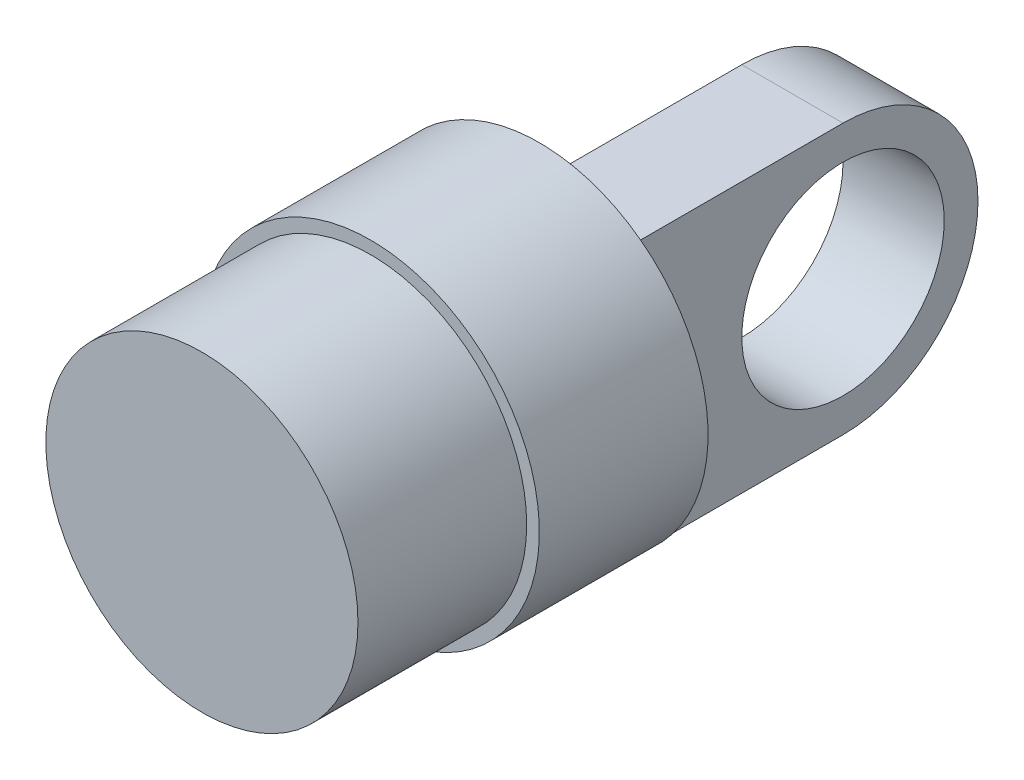
ISO-10303-21;
HEADER;
FILE_DESCRIPTION(('STEP AP214'),'2;1');
FILE_NAME('part.step','',(''),(''),'','','');
FILE_SCHEMA(('AUTOMOTIVE_DESIGN { 1 0 10303 214 1 1 1 1 }'));
ENDSEC;
DATA;
#1=APPLICATION_CONTEXT('core data for automotive mechanical design processes');
#2=APPLICATION_PROTOCOL_DEFINITION('international standard','automotive_design',2000,#1);
#3=PRODUCT_CONTEXT('',#1,'mechanical');
#4=PRODUCT('Part','Part','',(#3));
#5=PRODUCT_RELATED_PRODUCT_CATEGORY('part','',(#4));
#6=PRODUCT_DEFINITION_FORMATION('','',#4);
#7=PRODUCT_DEFINITION_CONTEXT('part definition',#1,'design');
#8=PRODUCT_DEFINITION('design','',#6,#7);
#9=PRODUCT_DEFINITION_SHAPE('','',#8);
#10=(LENGTH_UNIT() NAMED_UNIT(*) SI_UNIT(.MILLI.,.METRE.));
#11=(NAMED_UNIT(*) PLANE_ANGLE_UNIT() SI_UNIT($,.RADIAN.));
#12=(NAMED_UNIT(*) SI_UNIT($,.STERADIAN.) SOLID_ANGLE_UNIT());
#13=UNCERTAINTY_MEASURE_WITH_UNIT(LENGTH_MEASURE(1.E-05),#10,'distance_accuracy_value','');
#14=(GEOMETRIC_REPRESENTATION_CONTEXT(3) GLOBAL_UNCERTAINTY_ASSIGNED_CONTEXT((#13)) GLOBAL_UNIT_ASSIGNED_CONTEXT((#10,
#11,#12)) REPRESENTATION_CONTEXT('',''));
#15=CARTESIAN_POINT('',(0.,0.,0.));
#16=DIRECTION('',(0.,0.,1.));
#17=DIRECTION('',(1.,0.,0.));
#18=AXIS2_PLACEMENT_3D('',#15,#16,#17);
#19=CARTESIAN_POINT('',(6.,-8.,-30.));
#20=DIRECTION('',(1.,0.,0.));
#21=DIRECTION('',(0.,0.,-1.));
#22=AXIS2_PLACEMENT_3D('',#19,#20,#21);
#23=PLANE('',#22);
#24=CARTESIAN_POINT('',(6.,0.,-22.));
#25=DIRECTION('',(1.,0.,0.));
#26=DIRECTION('',(0.,0.,-1.));
#27=AXIS2_PLACEMENT_3D('',#24,#25,#26);
#28=CIRCLE('',#27,6.);
#29=CARTESIAN_POINT('',(6.,0.,-28.));
#30=VERTEX_POINT('',#29);
#31=EDGE_CURVE('E204',#30,#30,#28,.T.);
#32=ORIENTED_EDGE('',*,*,#31,.F.);
#33=EDGE_LOOP('',(#32));
#34=FACE_BOUND('',#33,.T.);
#35=DIRECTION('',(0.,0.,1.));
#36=VECTOR('',#35,1.);
#37=CARTESIAN_POINT('',(6.,-8.,-30.));
#38=LINE('',#37,#36);
#39=CARTESIAN_POINT('',(6.,-8.,-22.));
#40=VERTEX_POINT('',#39);
#41=CARTESIAN_POINT('',(6.,-8.,-10.));
#42=VERTEX_POINT('',#41);
#43=EDGE_CURVE('E142',#40,#42,#38,.T.);
#44=ORIENTED_EDGE('',*,*,#43,.F.);
#45=CARTESIAN_POINT('',(6.,0.,-22.));
#46=DIRECTION('',(1.,0.,0.));
#47=DIRECTION('',(0.,0.,-1.));
#48=AXIS2_PLACEMENT_3D('',#45,#46,#47);
#49=CIRCLE('',#48,8.);
#50=CARTESIAN_POINT('',(6.,8.,-22.));
#51=VERTEX_POINT('',#50);
#52=EDGE_CURVE('E138',#40,#51,#49,.T.);
#53=ORIENTED_EDGE('',*,*,#52,.T.);
#54=DIRECTION('',(0.,0.,1.));
#55=VECTOR('',#54,1.);
#56=CARTESIAN_POINT('',(6.,8.,-30.));
#57=LINE('',#56,#55);
#58=CARTESIAN_POINT('',(6.,8.,-10.));
#59=VERTEX_POINT('',#58);
#60=EDGE_CURVE('E135',#51,#59,#57,.T.);
#61=ORIENTED_EDGE('',*,*,#60,.T.);
#62=DIRECTION('',(0.,1.,0.));
#63=VECTOR('',#62,1.);
#64=CARTESIAN_POINT('',(6.,-8.,-10.));
#65=LINE('',#64,#63);
#66=EDGE_CURVE('E133',#42,#59,#65,.T.);
#67=ORIENTED_EDGE('',*,*,#66,.F.);
#68=EDGE_LOOP('',(#44,#53,#61,#67));
#69=FACE_BOUND('',#68,.T.);
#70=ADVANCED_FACE('F72',(#34,#69),#23,.T.);
#71=CARTESIAN_POINT('',(6.,-8.,-30.));
#72=DIRECTION('',(0.,1.,0.));
#73=DIRECTION('',(0.,0.,1.));
#74=AXIS2_PLACEMENT_3D('',#71,#72,#73);
#75=PLANE('',#74);
#76=DIRECTION('',(-1.,0.,0.));
#77=VECTOR('',#76,1.);
#78=CARTESIAN_POINT('',(6.,-8.,-10.));
#79=LINE('',#78,#77);
#80=CARTESIAN_POINT('',(0.,-8.,-10.));
#81=VERTEX_POINT('',#80);
#82=EDGE_CURVE('E132',#42,#81,#79,.T.);
#83=ORIENTED_EDGE('',*,*,#82,.T.);
#84=DIRECTION('',(0.,0.,-1.));
#85=VECTOR('',#84,1.);
#86=CARTESIAN_POINT('',(0.,-8.,-30.));
#87=LINE('',#86,#85);
#88=CARTESIAN_POINT('',(0.,-8.,-22.));
#89=VERTEX_POINT('',#88);
#90=EDGE_CURVE('E116',#81,#89,#87,.T.);
#91=ORIENTED_EDGE('',*,*,#90,.T.);
#92=DIRECTION('',(1.,0.,0.));
#93=VECTOR('',#92,1.);
#94=CARTESIAN_POINT('',(-24.,-8.,-22.));
#95=LINE('',#94,#93);
#96=EDGE_CURVE('E12',#40,#89,#95,.F.);
#97=ORIENTED_EDGE('',*,*,#96,.F.);
#98=ORIENTED_EDGE('',*,*,#43,.T.);
#99=EDGE_LOOP('',(#83,#91,#97,#98));
#100=FACE_BOUND('',#99,.T.);
#101=ADVANCED_FACE('F176',(#100),#75,.F.);
#102=CARTESIAN_POINT('',(6.,8.,-30.));
#103=DIRECTION('',(0.,1.,0.));
#104=DIRECTION('',(0.,0.,1.));
#105=AXIS2_PLACEMENT_3D('',#102,#103,#104);
#106=PLANE('',#105);
#107=DIRECTION('',(0.,0.,-1.));
#108=VECTOR('',#107,1.);
#109=CARTESIAN_POINT('',(0.,8.,-30.));
#110=LINE('',#109,#108);
#111=CARTESIAN_POINT('',(0.,8.,-10.));
#112=VERTEX_POINT('',#111);
#113=CARTESIAN_POINT('',(0.,8.,-22.));
#114=VERTEX_POINT('',#113);
#115=EDGE_CURVE('E88',#112,#114,#110,.T.);
#116=ORIENTED_EDGE('',*,*,#115,.F.);
#117=DIRECTION('',(-1.,0.,0.));
#118=VECTOR('',#117,1.);
#119=CARTESIAN_POINT('',(6.,8.,-10.));
#120=LINE('',#119,#118);
#121=EDGE_CURVE('E127',#59,#112,#120,.T.);
#122=ORIENTED_EDGE('',*,*,#121,.F.);
#123=ORIENTED_EDGE('',*,*,#60,.F.);
#124=DIRECTION('',(-1.,0.,0.));
#125=VECTOR('',#124,1.);
#126=CARTESIAN_POINT('',(10.,8.,-22.));
#127=LINE('',#126,#125);
#128=EDGE_CURVE('E129',#51,#114,#127,.T.);
#129=ORIENTED_EDGE('',*,*,#128,.T.);
#130=EDGE_LOOP('',(#116,#122,#123,#129));
#131=FACE_BOUND('',#130,.T.);
#132=ADVANCED_FACE('F125',(#131),#106,.T.);
#133=CARTESIAN_POINT('',(0.,0.,-10.));
#134=DIRECTION('',(0.,0.,-1.));
#135=DIRECTION('',(-1.,0.,0.));
#136=AXIS2_PLACEMENT_3D('',#133,#134,#135);
#137=PLANE('',#136);
#138=CARTESIAN_POINT('',(0.,0.,-10.));
#139=DIRECTION('',(0.,0.,-1.));
#140=DIRECTION('',(-1.,0.,0.));
#141=AXIS2_PLACEMENT_3D('',#138,#139,#140);
#142=CIRCLE('',#141,10.);
#143=EDGE_CURVE('E148',#59,#42,#142,.T.);
#144=ORIENTED_EDGE('',*,*,#143,.T.);
#145=ORIENTED_EDGE('',*,*,#66,.T.);
#146=EDGE_LOOP('',(#144,#145));
#147=FACE_BOUND('',#146,.T.);
#148=ADVANCED_FACE('F173',(#147),#137,.T.);
#149=CARTESIAN_POINT('',(0.,0.,10.));
#150=DIRECTION('',(0.,0.,-1.));
#151=DIRECTION('',(-1.,0.,0.));
#152=AXIS2_PLACEMENT_3D('',#149,#150,#151);
#153=CYLINDRICAL_SURFACE('',#152,9.25);
#154=CARTESIAN_POINT('',(0.,0.,10.));
#155=DIRECTION('',(0.,0.,1.));
#156=DIRECTION('',(1.,0.,0.));
#157=AXIS2_PLACEMENT_3D('',#154,#155,#156);
#158=CIRCLE('',#157,9.25);
#159=CARTESIAN_POINT('',(9.25,0.,10.));
#160=VERTEX_POINT('',#159);
#161=EDGE_CURVE('E81',#160,#160,#158,.T.);
#162=ORIENTED_EDGE('',*,*,#161,.F.);
#163=EDGE_LOOP('',(#162));
#164=FACE_BOUND('',#163,.T.);
#165=CARTESIAN_POINT('',(0.,0.,0.));
#166=DIRECTION('',(0.,0.,1.));
#167=DIRECTION('',(1.,0.,0.));
#168=AXIS2_PLACEMENT_3D('',#165,#166,#167);
#169=CIRCLE('',#168,9.25);
#170=CARTESIAN_POINT('',(9.25,0.,0.));
#171=VERTEX_POINT('',#170);
#172=EDGE_CURVE('E147',#171,#171,#169,.T.);
#173=ORIENTED_EDGE('',*,*,#172,.T.);
#174=EDGE_LOOP('',(#173));
#175=FACE_BOUND('',#174,.T.);
#176=ADVANCED_FACE('F74',(#164,#175),#153,.T.);
#177=CARTESIAN_POINT('',(0.,0.,10.));
#178=DIRECTION('',(0.,0.,1.));
#179=DIRECTION('',(1.,0.,0.));
#180=AXIS2_PLACEMENT_3D('',#177,#178,#179);
#181=PLANE('',#180);
#182=ORIENTED_EDGE('',*,*,#161,.T.);
#183=EDGE_LOOP('',(#182));
#184=FACE_BOUND('',#183,.T.);
#185=ADVANCED_FACE('F166',(#184),#181,.T.);
#186=CARTESIAN_POINT('',(0.,0.,-10.));
#187=DIRECTION('',(0.,0.,1.));
#188=DIRECTION('',(1.,0.,0.));
#189=AXIS2_PLACEMENT_3D('',#186,#187,#188);
#190=CYLINDRICAL_SURFACE('',#189,10.);
#191=EDGE_CURVE('E95',#42,#59,#142,.T.);
#192=ORIENTED_EDGE('',*,*,#191,.F.);
#193=ORIENTED_EDGE('',*,*,#143,.F.);
#194=EDGE_LOOP('',(#192,#193));
#195=FACE_BOUND('',#194,.T.);
#196=CARTESIAN_POINT('',(0.,0.,0.));
#197=DIRECTION('',(0.,0.,-1.));
#198=DIRECTION('',(-1.,0.,0.));
#199=AXIS2_PLACEMENT_3D('',#196,#197,#198);
#200=CIRCLE('',#199,10.);
#201=CARTESIAN_POINT('',(-10.,0.,0.));
#202=VERTEX_POINT('',#201);
#203=EDGE_CURVE('E144',#202,#202,#200,.T.);
#204=ORIENTED_EDGE('',*,*,#203,.T.);
#205=EDGE_LOOP('',(#204));
#206=FACE_BOUND('',#205,.T.);
#207=ADVANCED_FACE('F164',(#195,#206),#190,.T.);
#208=ORIENTED_EDGE('',*,*,#82,.F.);
#209=ORIENTED_EDGE('',*,*,#191,.T.);
#210=ORIENTED_EDGE('',*,*,#121,.T.);
#211=DIRECTION('',(0.,1.,0.));
#212=VECTOR('',#211,1.);
#213=CARTESIAN_POINT('',(0.,-10.,-10.));
#214=LINE('',#213,#212);
#215=EDGE_CURVE('E113',#81,#112,#214,.T.);
#216=ORIENTED_EDGE('',*,*,#215,.F.);
#217=EDGE_LOOP('',(#208,#209,#210,#216));
#218=FACE_BOUND('',#217,.T.);
#219=ADVANCED_FACE('F131',(#218),#137,.T.);
#220=CARTESIAN_POINT('',(0.,0.,0.));
#221=DIRECTION('',(0.,0.,-1.));
#222=DIRECTION('',(-1.,0.,0.));
#223=AXIS2_PLACEMENT_3D('',#220,#221,#222);
#224=PLANE('',#223);
#225=ORIENTED_EDGE('',*,*,#172,.F.);
#226=EDGE_LOOP('',(#225));
#227=FACE_BOUND('',#226,.T.);
#228=ORIENTED_EDGE('',*,*,#203,.F.);
#229=EDGE_LOOP('',(#228));
#230=FACE_BOUND('',#229,.T.);
#231=ADVANCED_FACE('F157',(#227,#230),#224,.F.);
#232=CARTESIAN_POINT('',(10.,0.,-22.));
#233=DIRECTION('',(-1.,0.,0.));
#234=DIRECTION('',(0.,0.,1.));
#235=AXIS2_PLACEMENT_3D('',#232,#233,#234);
#236=CYLINDRICAL_SURFACE('',#235,8.);
#237=ORIENTED_EDGE('',*,*,#96,.T.);
#238=CARTESIAN_POINT('',(0.,0.,-22.));
#239=DIRECTION('',(1.,0.,0.));
#240=DIRECTION('',(0.,0.,-1.));
#241=AXIS2_PLACEMENT_3D('',#238,#239,#240);
#242=CIRCLE('',#241,8.);
#243=EDGE_CURVE('E202',#114,#89,#242,.F.);
#244=ORIENTED_EDGE('',*,*,#243,.F.);
#245=ORIENTED_EDGE('',*,*,#128,.F.);
#246=ORIENTED_EDGE('',*,*,#52,.F.);
#247=EDGE_LOOP('',(#237,#244,#245,#246));
#248=FACE_BOUND('',#247,.T.);
#249=ADVANCED_FACE('F160',(#248),#236,.T.);
#250=CARTESIAN_POINT('',(-10.,0.,-22.));
#251=DIRECTION('',(1.,0.,0.));
#252=DIRECTION('',(0.,0.,-1.));
#253=AXIS2_PLACEMENT_3D('',#250,#251,#252);
#254=CYLINDRICAL_SURFACE('',#253,6.);
#255=CARTESIAN_POINT('',(0.,0.,-22.));
#256=DIRECTION('',(1.,0.,0.));
#257=DIRECTION('',(0.,0.,-1.));
#258=AXIS2_PLACEMENT_3D('',#255,#256,#257);
#259=CIRCLE('',#258,6.);
#260=CARTESIAN_POINT('',(0.,0.,-28.));
#261=VERTEX_POINT('',#260);
#262=EDGE_CURVE('E76',#261,#261,#259,.F.);
#263=ORIENTED_EDGE('',*,*,#262,.T.);
#264=EDGE_LOOP('',(#263));
#265=FACE_BOUND('',#264,.T.);
#266=ORIENTED_EDGE('',*,*,#31,.T.);
#267=EDGE_LOOP('',(#266));
#268=FACE_BOUND('',#267,.T.);
#269=ADVANCED_FACE('F191',(#265,#268),#254,.F.);
#270=CARTESIAN_POINT('',(0.,-10.,-30.));
#271=DIRECTION('',(1.,0.,0.));
#272=DIRECTION('',(0.,0.,-1.));
#273=AXIS2_PLACEMENT_3D('',#270,#271,#272);
#274=PLANE('',#273);
#275=ORIENTED_EDGE('',*,*,#262,.F.);
#276=EDGE_LOOP('',(#275));
#277=FACE_BOUND('',#276,.T.);
#278=ORIENTED_EDGE('',*,*,#215,.T.);
#279=ORIENTED_EDGE('',*,*,#115,.T.);
#280=ORIENTED_EDGE('',*,*,#243,.T.);
#281=ORIENTED_EDGE('',*,*,#90,.F.);
#282=EDGE_LOOP('',(#278,#279,#280,#281));
#283=FACE_BOUND('',#282,.T.);
#284=ADVANCED_FACE('F114',(#277,#283),#274,.F.);
#285=CLOSED_SHELL('',(#70,#101,#132,#148,#176,#185,#207,#219,#231,#249,#269,#284));
#286=MANIFOLD_SOLID_BREP('B2',#285);
#287=ADVANCED_BREP_SHAPE_REPRESENTATION('',(#18,#286),#14);
#288=SHAPE_DEFINITION_REPRESENTATION(#9,#287);
ENDSEC;
END-ISO-10303-21;
